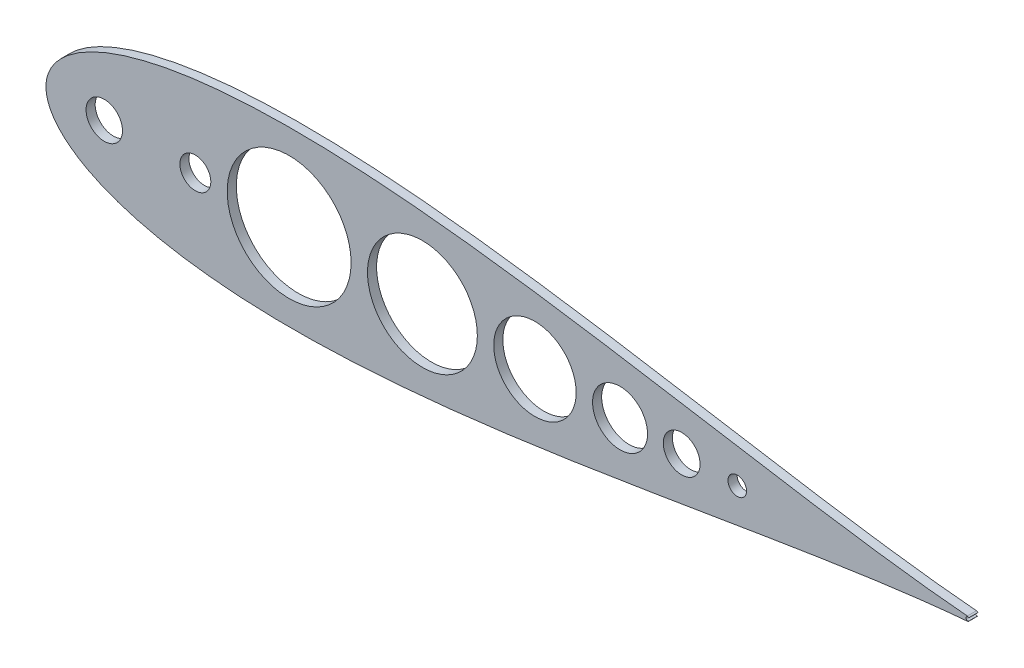
ISO-10303-21;
HEADER;
FILE_DESCRIPTION(('STEP AP214'),'2;1');
FILE_NAME('part.step','',(''),(''),'','','');
FILE_SCHEMA(('AUTOMOTIVE_DESIGN { 1 0 10303 214 1 1 1 1 }'));
ENDSEC;
DATA;
#1=APPLICATION_CONTEXT('core data for automotive mechanical design processes');
#2=APPLICATION_PROTOCOL_DEFINITION('international standard','automotive_design',2000,#1);
#3=PRODUCT_CONTEXT('',#1,'mechanical');
#4=PRODUCT('Part','Part','',(#3));
#5=PRODUCT_RELATED_PRODUCT_CATEGORY('part','',(#4));
#6=PRODUCT_DEFINITION_FORMATION('','',#4);
#7=PRODUCT_DEFINITION_CONTEXT('part definition',#1,'design');
#8=PRODUCT_DEFINITION('design','',#6,#7);
#9=PRODUCT_DEFINITION_SHAPE('','',#8);
#10=(LENGTH_UNIT() NAMED_UNIT(*) SI_UNIT(.MILLI.,.METRE.));
#11=(NAMED_UNIT(*) PLANE_ANGLE_UNIT() SI_UNIT($,.RADIAN.));
#12=(NAMED_UNIT(*) SI_UNIT($,.STERADIAN.) SOLID_ANGLE_UNIT());
#13=UNCERTAINTY_MEASURE_WITH_UNIT(LENGTH_MEASURE(1.E-05),#10,'distance_accuracy_value','');
#14=(GEOMETRIC_REPRESENTATION_CONTEXT(3) GLOBAL_UNCERTAINTY_ASSIGNED_CONTEXT((#13)) GLOBAL_UNIT_ASSIGNED_CONTEXT((#10,
#11,#12)) REPRESENTATION_CONTEXT('',''));
#15=CARTESIAN_POINT('',(0.,0.,0.));
#16=DIRECTION('',(0.,0.,1.));
#17=DIRECTION('',(1.,0.,0.));
#18=AXIS2_PLACEMENT_3D('',#15,#16,#17);
#19=CARTESIAN_POINT('',(670.559999999995,-4.68653165320437E-13,6.34999999999986));
#20=CARTESIAN_POINT('',(670.559999999995,0.0156785949263688,6.34999999999986));
#21=CARTESIAN_POINT('',(666.344759682881,0.0546967077378405,6.34999999999986));
#22=CARTESIAN_POINT('',(662.850933167962,0.234427605388089,6.34999999999986));
#23=CARTESIAN_POINT('',(656.504964310744,0.543558382914457,6.34999999999986));
#24=CARTESIAN_POINT('',(649.292951764016,1.0347712527945,6.34999999999986));
#25=CARTESIAN_POINT('',(640.491559639747,1.73191957841824,6.34999999999986));
#26=CARTESIAN_POINT('',(630.413817461932,2.66338549322046,6.34999999999986));
#27=CARTESIAN_POINT('',(619.014124193098,3.84925366408526,6.34999999999986));
#28=CARTESIAN_POINT('',(606.374988512377,5.30442898343126,6.34999999999986));
#29=CARTESIAN_POINT('',(592.543922516213,7.0376349071005,6.34999999999986));
#30=CARTESIAN_POINT('',(577.585454095334,9.05063614704178,6.34999999999986));
#31=CARTESIAN_POINT('',(561.564270734495,11.338919624911,6.34999999999986));
#32=CARTESIAN_POINT('',(544.549749945779,13.8906653749142,6.34999999999986));
#33=CARTESIAN_POINT('',(526.614143657611,16.6877207529691,6.34999999999986));
#34=CARTESIAN_POINT('',(507.832591566435,19.705111662944,6.34999999999986));
#35=CARTESIAN_POINT('',(488.282710288458,22.9116726009051,6.34999999999986));
#36=CARTESIAN_POINT('',(468.044367734568,26.2704360601485,6.34999999999986));
#37=CARTESIAN_POINT('',(447.199424328285,29.7390074319527,6.34999999999986));
#38=CARTESIAN_POINT('',(425.831595832132,33.2703241206413,6.34999999999986));
#39=CARTESIAN_POINT('',(404.026315660115,36.8132205450789,6.34999999999986));
#40=CARTESIAN_POINT('',(381.870662855573,40.3132668564462,6.34999999999986));
#41=CARTESIAN_POINT('',(359.45331489519,43.7135025323022,6.34999999999986));
#42=CARTESIAN_POINT('',(336.864544150042,46.9554474567624,6.34999999999986));
#43=CARTESIAN_POINT('',(314.196207315011,49.9798438951445,6.34999999999986));
#44=CARTESIAN_POINT('',(291.541767703988,52.7277127038913,6.34999999999986));
#45=CARTESIAN_POINT('',(268.996310773138,55.1412010116264,6.34999999999986));
#46=CARTESIAN_POINT('',(246.656558649997,57.1646038288049,6.34999999999986));
#47=CARTESIAN_POINT('',(224.6208608972,58.7451766411795,6.34999999999986));
#48=CARTESIAN_POINT('',(202.989192599402,59.8341217002374,6.34999999999986));
#49=CARTESIAN_POINT('',(181.863132616041,60.3875061421196,6.34999999999986));
#50=CARTESIAN_POINT('',(161.345829026567,60.3669613241368,6.34999999999986));
#51=CARTESIAN_POINT('',(141.542033827971,59.7398958243373,6.34999999999986));
#52=CARTESIAN_POINT('',(122.558104572901,58.481758103839,6.34999999999986));
#53=CARTESIAN_POINT('',(104.502313427195,56.5743039322429,6.34999999999986));
#54=CARTESIAN_POINT('',(87.4850186361542,54.0089351991651,6.34999999999986));
#55=CARTESIAN_POINT('',(71.6196960831894,50.7847520029954,6.34999999999986));
#56=CARTESIAN_POINT('',(57.0237097246995,46.9125430655855,6.34999999999986));
#57=CARTESIAN_POINT('',(43.8204543300273,42.4150024601013,6.34999999999986));
#58=CARTESIAN_POINT('',(32.1416452388821,37.3322040286459,6.34999999999986));
#59=CARTESIAN_POINT('',(22.1291073753191,31.7314553388242,6.34999999999986));
#60=CARTESIAN_POINT('',(13.932423523913,25.7264121059533,6.34999999999986));
#61=CARTESIAN_POINT('',(7.68961648909836,19.5132076319132,6.34999999999986));
#62=CARTESIAN_POINT('',(3.46313634309121,13.4203544206608,6.34999999999986));
#63=CARTESIAN_POINT('',(1.10633322756684,7.92338943472271,6.34999999999986));
#64=CARTESIAN_POINT('',(0.154611581573608,3.51379661507287,6.34999999999986));
#65=CARTESIAN_POINT('',(-0.062151597606766,1.52655665885959E-13,6.34999999999986));
#66=CARTESIAN_POINT('',(0.154611581573649,-3.51379661507316,6.34999999999986));
#67=CARTESIAN_POINT('',(1.10633322756687,-7.92338943472271,6.34999999999986));
#68=CARTESIAN_POINT('',(3.46313634309126,-13.420354420661,6.34999999999986));
#69=CARTESIAN_POINT('',(7.6896164890982,-19.5132076319134,6.34999999999986));
#70=CARTESIAN_POINT('',(13.9324235239131,-25.7264121059535,6.34999999999986));
#71=CARTESIAN_POINT('',(22.1291073753193,-31.7314553388245,6.34999999999986));
#72=CARTESIAN_POINT('',(32.1416452388821,-37.3322040286461,6.34999999999986));
#73=CARTESIAN_POINT('',(43.8204543300276,-42.4150024601015,6.34999999999986));
#74=CARTESIAN_POINT('',(57.0237097246994,-46.9125430655857,6.34999999999986));
#75=CARTESIAN_POINT('',(71.6196960831895,-50.7847520029956,6.34999999999986));
#76=CARTESIAN_POINT('',(87.4850186361541,-54.0089351991653,6.34999999999986));
#77=CARTESIAN_POINT('',(104.502313427195,-56.5743039322431,6.34999999999986));
#78=CARTESIAN_POINT('',(122.558104572901,-58.4817581038392,6.34999999999986));
#79=CARTESIAN_POINT('',(141.542033827971,-59.7398958243373,6.34999999999986));
#80=CARTESIAN_POINT('',(161.345829026567,-60.3669613241367,6.34999999999986));
#81=CARTESIAN_POINT('',(181.863132616041,-60.3875061421197,6.34999999999986));
#82=CARTESIAN_POINT('',(202.989192599402,-59.8341217002374,6.34999999999986));
#83=CARTESIAN_POINT('',(224.6208608972,-58.7451766411793,6.34999999999986));
#84=CARTESIAN_POINT('',(246.656558649996,-57.1646038288046,6.34999999999986));
#85=CARTESIAN_POINT('',(268.996310773136,-55.1412010116262,6.34999999999986));
#86=CARTESIAN_POINT('',(291.541767703988,-52.727712703891,6.34999999999986));
#87=CARTESIAN_POINT('',(314.19620731501,-49.9798438951439,6.34999999999986));
#88=CARTESIAN_POINT('',(336.864544150042,-46.9554474567621,6.34999999999986));
#89=CARTESIAN_POINT('',(359.453314895188,-43.7135025323018,6.34999999999986));
#90=CARTESIAN_POINT('',(381.870662855573,-40.3132668564457,6.34999999999986));
#91=CARTESIAN_POINT('',(404.026315660113,-36.8132205450786,6.34999999999986));
#92=CARTESIAN_POINT('',(425.831595832131,-33.2703241206408,6.34999999999986));
#93=CARTESIAN_POINT('',(447.199424328285,-29.7390074319522,6.34999999999986));
#94=CARTESIAN_POINT('',(468.044367734567,-26.2704360601482,6.34999999999986));
#95=CARTESIAN_POINT('',(488.282710288458,-22.9116726009046,6.34999999999986));
#96=CARTESIAN_POINT('',(507.832591566435,-19.7051116629438,6.34999999999986));
#97=CARTESIAN_POINT('',(526.614143657612,-16.6877207529685,6.34999999999986));
#98=CARTESIAN_POINT('',(544.54974994578,-13.890665374914,6.34999999999986));
#99=CARTESIAN_POINT('',(561.564270734495,-11.3389196249107,6.34999999999986));
#100=CARTESIAN_POINT('',(577.585454095334,-9.0506361470414,6.34999999999986));
#101=CARTESIAN_POINT('',(592.543922516212,-7.03763490710037,6.34999999999986));
#102=CARTESIAN_POINT('',(606.374988512377,-5.30442898343094,6.34999999999986));
#103=CARTESIAN_POINT('',(619.014124193097,-3.84925366408511,6.34999999999986));
#104=CARTESIAN_POINT('',(630.413817461931,-2.66338549322031,6.34999999999986));
#105=CARTESIAN_POINT('',(640.491559639746,-1.73191957841822,6.34999999999986));
#106=CARTESIAN_POINT('',(649.292951764016,-1.03477125279468,6.34999999999986));
#107=CARTESIAN_POINT('',(656.504964310745,-0.543558382914665,6.34999999999986));
#108=CARTESIAN_POINT('',(662.850933167962,-0.234427605389047,6.34999999999986));
#109=CARTESIAN_POINT('',(666.34475968288,-0.0546967077383817,6.34999999999986));
#110=CARTESIAN_POINT('',(670.559999999995,-0.0156785949273065,6.34999999999986));
#111=CARTESIAN_POINT('',(670.559999999995,-4.68653165320437E-13,6.34999999999986));
#112=B_SPLINE_CURVE_WITH_KNOTS('',3,(#19,#20,#21,#22,#23,#24,#25,#26,#27,#28,#29,#30,#31,#32,
#33,#34,#35,#36,#37,#38,#39,#40,#41,#42,#43,#44,#45,#46,#47,#48,#49,#50,#51,#52,#53,#54,#55,#56,
#57,#58,#59,#60,#61,#62,#63,#64,#65,#66,#67,#68,#69,#70,#71,#72,#73,#74,#75,#76,#77,#78,#79,#80,
#81,#82,#83,#84,#85,#86,#87,#88,#89,#90,#91,#92,#93,#94,#95,#96,#97,#98,#99,#100,#101,#102,#103,
#104,#105,#106,#107,#108,#109,#110,#111),.UNSPECIFIED.,.T.,.F.,(4,1,1,1,1,1,1,1,1,1,1,1,1,1,1,1,
1,1,1,1,1,1,1,1,1,1,1,1,1,1,1,1,1,1,1,1,1,1,1,1,1,1,1,1,1,1,1,1,1,1,1,1,1,1,1,1,1,1,1,1,1,1,1,1,
1,1,1,1,1,1,1,1,1,1,1,1,1,1,1,1,1,1,1,1,1,1,1,1,1,1,4),(0.,0.00216777795588342,
0.00539478220000884,0.00966720698444134,0.0149667883303173,0.0212708876900959,
0.0285525550130683,0.0367806836725549,0.0459201019032637,0.0559317636633187,0.0667728836144854,
0.0783971303496518,0.0907548266908363,0.103793164577546,0.117456431914319,0.131686225652521,
0.146421738497113,0.161599998000845,0.177156132626574,0.193023668070302,0.209134785631037,
0.225420632511523,0.241811601924249,0.258237646860869,0.274628556698349,0.290914287398014,
0.307025228908797,0.322892517177238,0.33844834182358,0.353626206573582,0.368361231970712,
0.382590427827798,0.396252960572084,0.40929041186716,0.421647009590256,0.433269881487031,
0.444109248914041,0.454118639688981,0.463255054987312,0.471479113777303,0.478755288570903,
0.485052318112802,0.490344025694165,0.494609832614287,0.497833231437255,0.5,0.502166768562745,
0.505390167385713,0.509655974305835,0.514947681887198,0.521244711429097,0.528520886222697,
0.536744945012688,0.545881360311019,0.555890751085959,0.566730118512969,0.578352990409744,
0.59070958813284,0.603747039427916,0.617409572172202,0.631638768029288,0.646373793426418,
0.66155165817642,0.677107482822761,0.692974771091203,0.709085712601986,0.725371443301651,
0.741762353139131,0.758188398075751,0.774579367488477,0.790865214368963,0.806976331929698,
0.822843867373426,0.838400001999155,0.853578261502887,0.868313774347479,0.882543568085681,
0.896206835422454,0.909245173309164,0.921602869650348,0.933227116385514,0.944068236336681,
0.954079898096736,0.963219316327445,0.971447444986932,0.978729112309904,0.985033211669683,
0.990332793015559,0.994605217799991,0.997832222044117,1.),.UNSPECIFIED.);
#113=DIRECTION('',(0.,0.,-1.));
#114=VECTOR('',#113,1.);
#115=SURFACE_OF_LINEAR_EXTRUSION('',#112,#114);
#116=CARTESIAN_POINT('',(670.559999999995,-4.68653165320437E-13,0.));
#117=CARTESIAN_POINT('',(670.559999999995,0.0156785949263688,0.));
#118=CARTESIAN_POINT('',(666.344759682881,0.0546967077378405,0.));
#119=CARTESIAN_POINT('',(662.850933167962,0.234427605388089,0.));
#120=CARTESIAN_POINT('',(656.504964310744,0.543558382914457,0.));
#121=CARTESIAN_POINT('',(649.292951764016,1.0347712527945,0.));
#122=CARTESIAN_POINT('',(640.491559639747,1.73191957841824,0.));
#123=CARTESIAN_POINT('',(630.413817461932,2.66338549322046,0.));
#124=CARTESIAN_POINT('',(619.014124193098,3.84925366408526,0.));
#125=CARTESIAN_POINT('',(606.374988512377,5.30442898343126,0.));
#126=CARTESIAN_POINT('',(592.543922516213,7.0376349071005,0.));
#127=CARTESIAN_POINT('',(577.585454095334,9.05063614704178,0.));
#128=CARTESIAN_POINT('',(561.564270734495,11.338919624911,0.));
#129=CARTESIAN_POINT('',(544.549749945779,13.8906653749142,0.));
#130=CARTESIAN_POINT('',(526.614143657611,16.6877207529691,0.));
#131=CARTESIAN_POINT('',(507.832591566435,19.705111662944,0.));
#132=CARTESIAN_POINT('',(488.282710288458,22.9116726009051,0.));
#133=CARTESIAN_POINT('',(468.044367734568,26.2704360601485,0.));
#134=CARTESIAN_POINT('',(447.199424328285,29.7390074319527,0.));
#135=CARTESIAN_POINT('',(425.831595832132,33.2703241206413,0.));
#136=CARTESIAN_POINT('',(404.026315660115,36.8132205450789,0.));
#137=CARTESIAN_POINT('',(381.870662855573,40.3132668564462,0.));
#138=CARTESIAN_POINT('',(359.45331489519,43.7135025323022,0.));
#139=CARTESIAN_POINT('',(336.864544150042,46.9554474567624,0.));
#140=CARTESIAN_POINT('',(314.196207315011,49.9798438951445,0.));
#141=CARTESIAN_POINT('',(291.541767703988,52.7277127038913,0.));
#142=CARTESIAN_POINT('',(268.996310773138,55.1412010116264,0.));
#143=CARTESIAN_POINT('',(246.656558649997,57.1646038288049,0.));
#144=CARTESIAN_POINT('',(224.6208608972,58.7451766411795,0.));
#145=CARTESIAN_POINT('',(202.989192599402,59.8341217002374,0.));
#146=CARTESIAN_POINT('',(181.863132616041,60.3875061421196,0.));
#147=CARTESIAN_POINT('',(161.345829026567,60.3669613241368,0.));
#148=CARTESIAN_POINT('',(141.542033827971,59.7398958243373,0.));
#149=CARTESIAN_POINT('',(122.558104572901,58.481758103839,0.));
#150=CARTESIAN_POINT('',(104.502313427195,56.5743039322429,0.));
#151=CARTESIAN_POINT('',(87.4850186361542,54.0089351991651,0.));
#152=CARTESIAN_POINT('',(71.6196960831894,50.7847520029954,0.));
#153=CARTESIAN_POINT('',(57.0237097246996,46.9125430655856,0.));
#154=CARTESIAN_POINT('',(43.8204543300273,42.4150024601013,0.));
#155=CARTESIAN_POINT('',(32.1416452388821,37.3322040286459,0.));
#156=CARTESIAN_POINT('',(22.1291073753191,31.7314553388242,0.));
#157=CARTESIAN_POINT('',(13.932423523913,25.7264121059533,0.));
#158=CARTESIAN_POINT('',(7.68961648909836,19.5132076319132,0.));
#159=CARTESIAN_POINT('',(3.46313634309121,13.4203544206608,0.));
#160=CARTESIAN_POINT('',(1.10633322756684,7.92338943472271,0.));
#161=CARTESIAN_POINT('',(0.154611581573608,3.51379661507287,0.));
#162=CARTESIAN_POINT('',(-0.062151597606766,1.52655665885959E-13,0.));
#163=CARTESIAN_POINT('',(0.154611581573649,-3.51379661507316,0.));
#164=CARTESIAN_POINT('',(1.10633322756687,-7.92338943472271,0.));
#165=CARTESIAN_POINT('',(3.46313634309126,-13.420354420661,0.));
#166=CARTESIAN_POINT('',(7.6896164890982,-19.5132076319134,0.));
#167=CARTESIAN_POINT('',(13.9324235239131,-25.7264121059535,0.));
#168=CARTESIAN_POINT('',(22.1291073753193,-31.7314553388245,0.));
#169=CARTESIAN_POINT('',(32.1416452388821,-37.3322040286461,0.));
#170=CARTESIAN_POINT('',(43.8204543300276,-42.4150024601015,0.));
#171=CARTESIAN_POINT('',(57.0237097246994,-46.9125430655857,0.));
#172=CARTESIAN_POINT('',(71.6196960831895,-50.7847520029956,0.));
#173=CARTESIAN_POINT('',(87.4850186361541,-54.0089351991653,0.));
#174=CARTESIAN_POINT('',(104.502313427195,-56.5743039322432,0.));
#175=CARTESIAN_POINT('',(122.558104572901,-58.4817581038392,0.));
#176=CARTESIAN_POINT('',(141.542033827971,-59.7398958243373,0.));
#177=CARTESIAN_POINT('',(161.345829026567,-60.3669613241368,0.));
#178=CARTESIAN_POINT('',(181.863132616041,-60.3875061421197,0.));
#179=CARTESIAN_POINT('',(202.989192599402,-59.8341217002374,0.));
#180=CARTESIAN_POINT('',(224.6208608972,-58.7451766411793,0.));
#181=CARTESIAN_POINT('',(246.656558649996,-57.1646038288046,0.));
#182=CARTESIAN_POINT('',(268.996310773136,-55.1412010116262,0.));
#183=CARTESIAN_POINT('',(291.541767703988,-52.727712703891,0.));
#184=CARTESIAN_POINT('',(314.19620731501,-49.9798438951439,0.));
#185=CARTESIAN_POINT('',(336.864544150042,-46.9554474567621,0.));
#186=CARTESIAN_POINT('',(359.453314895188,-43.7135025323018,0.));
#187=CARTESIAN_POINT('',(381.870662855573,-40.3132668564457,0.));
#188=CARTESIAN_POINT('',(404.026315660113,-36.8132205450786,0.));
#189=CARTESIAN_POINT('',(425.831595832131,-33.2703241206408,0.));
#190=CARTESIAN_POINT('',(447.199424328285,-29.7390074319522,0.));
#191=CARTESIAN_POINT('',(468.044367734567,-26.2704360601482,0.));
#192=CARTESIAN_POINT('',(488.282710288458,-22.9116726009046,0.));
#193=CARTESIAN_POINT('',(507.832591566435,-19.7051116629438,0.));
#194=CARTESIAN_POINT('',(526.614143657612,-16.6877207529685,0.));
#195=CARTESIAN_POINT('',(544.54974994578,-13.890665374914,0.));
#196=CARTESIAN_POINT('',(561.564270734495,-11.3389196249107,0.));
#197=CARTESIAN_POINT('',(577.585454095334,-9.0506361470414,0.));
#198=CARTESIAN_POINT('',(592.543922516212,-7.03763490710037,0.));
#199=CARTESIAN_POINT('',(606.374988512377,-5.30442898343094,0.));
#200=CARTESIAN_POINT('',(619.014124193097,-3.84925366408511,0.));
#201=CARTESIAN_POINT('',(630.413817461931,-2.66338549322031,0.));
#202=CARTESIAN_POINT('',(640.491559639746,-1.73191957841822,0.));
#203=CARTESIAN_POINT('',(649.292951764016,-1.03477125279468,0.));
#204=CARTESIAN_POINT('',(656.504964310745,-0.543558382914665,0.));
#205=CARTESIAN_POINT('',(662.850933167962,-0.234427605389047,0.));
#206=CARTESIAN_POINT('',(666.34475968288,-0.0546967077383817,0.));
#207=CARTESIAN_POINT('',(670.559999999995,-0.0156785949273065,0.));
#208=CARTESIAN_POINT('',(670.559999999995,-4.68653165320437E-13,0.));
#209=B_SPLINE_CURVE_WITH_KNOTS('',3,(#116,#117,#118,#119,#120,#121,#122,#123,#124,#125,#126,
#127,#128,#129,#130,#131,#132,#133,#134,#135,#136,#137,#138,#139,#140,#141,#142,#143,#144,#145,
#146,#147,#148,#149,#150,#151,#152,#153,#154,#155,#156,#157,#158,#159,#160,#161,#162,#163,#164,
#165,#166,#167,#168,#169,#170,#171,#172,#173,#174,#175,#176,#177,#178,#179,#180,#181,#182,#183,
#184,#185,#186,#187,#188,#189,#190,#191,#192,#193,#194,#195,#196,#197,#198,#199,#200,#201,#202,
#203,#204,#205,#206,#207,#208),.UNSPECIFIED.,.T.,.F.,(4,1,1,1,1,1,1,1,1,1,1,1,1,1,1,1,1,1,1,1,1,
1,1,1,1,1,1,1,1,1,1,1,1,1,1,1,1,1,1,1,1,1,1,1,1,1,1,1,1,1,1,1,1,1,1,1,1,1,1,1,1,1,1,1,1,1,1,1,1,
1,1,1,1,1,1,1,1,1,1,1,1,1,1,1,1,1,1,1,1,1,4),(0.,0.00216777795588342,0.00539478220000884,
0.00966720698444134,0.0149667883303173,0.0212708876900959,0.0285525550130683,0.0367806836725549,
0.0459201019032637,0.0559317636633187,0.0667728836144854,0.0783971303496518,0.0907548266908363,
0.103793164577546,0.117456431914319,0.131686225652521,0.146421738497113,0.161599998000845,
0.177156132626574,0.193023668070302,0.209134785631037,0.225420632511523,0.241811601924249,
0.258237646860869,0.274628556698349,0.290914287398014,0.307025228908797,0.322892517177238,
0.33844834182358,0.353626206573582,0.368361231970712,0.382590427827798,0.396252960572084,
0.40929041186716,0.421647009590256,0.433269881487031,0.444109248914041,0.454118639688981,
0.463255054987312,0.471479113777303,0.478755288570903,0.485052318112802,0.490344025694165,
0.494609832614287,0.497833231437255,0.5,0.502166768562745,0.505390167385713,0.509655974305835,
0.514947681887198,0.521244711429097,0.528520886222697,0.536744945012688,0.545881360311019,
0.555890751085959,0.566730118512969,0.578352990409744,0.59070958813284,0.603747039427916,
0.617409572172202,0.631638768029288,0.646373793426418,0.66155165817642,0.677107482822761,
0.692974771091203,0.709085712601986,0.725371443301651,0.741762353139131,0.758188398075751,
0.774579367488477,0.790865214368963,0.806976331929698,0.822843867373426,0.838400001999155,
0.853578261502887,0.868313774347479,0.882543568085681,0.896206835422454,0.909245173309164,
0.921602869650348,0.933227116385514,0.944068236336681,0.954079898096736,0.963219316327445,
0.971447444986932,0.978729112309904,0.985033211669683,0.990332793015559,0.994605217799991,
0.997832222044117,1.),.UNSPECIFIED.);
#210=CARTESIAN_POINT('',(642.510849283039,1.58203911233987,0.));
#211=VERTEX_POINT('',#210);
#212=CARTESIAN_POINT('',(642.51084928304,-1.58203911233961,0.));
#213=VERTEX_POINT('',#212);
#214=EDGE_CURVE('E86',#211,#213,#209,.T.);
#215=ORIENTED_EDGE('',*,*,#214,.T.);
#216=DIRECTION('',(0.,0.,-1.));
#217=VECTOR('',#216,1.);
#218=CARTESIAN_POINT('',(642.51084928304,-1.58203911233961,6.34999999999986));
#219=LINE('',#218,#217);
#220=CARTESIAN_POINT('',(642.51084928304,-1.58203911233961,6.34999999999986));
#221=VERTEX_POINT('',#220);
#222=EDGE_CURVE('E13',#221,#213,#219,.T.);
#223=ORIENTED_EDGE('',*,*,#222,.F.);
#224=CARTESIAN_POINT('',(642.510849283039,1.58203911233987,6.34999999999986));
#225=VERTEX_POINT('',#224);
#226=EDGE_CURVE('E91',#225,#221,#112,.T.);
#227=ORIENTED_EDGE('',*,*,#226,.F.);
#228=DIRECTION('',(0.,0.,-1.));
#229=VECTOR('',#228,1.);
#230=CARTESIAN_POINT('',(642.510849283039,1.58203911233987,6.34999999999986));
#231=LINE('',#230,#229);
#232=EDGE_CURVE('E110',#225,#211,#231,.T.);
#233=ORIENTED_EDGE('',*,*,#232,.T.);
#234=EDGE_LOOP('',(#215,#223,#227,#233));
#235=FACE_BOUND('',#234,.T.);
#236=ADVANCED_FACE('F56',(#235),#115,.F.);
#237=CARTESIAN_POINT('',(642.379287521774,0.,6.34999999999986));
#238=DIRECTION('',(0.,0.,-1.));
#239=DIRECTION('',(-0.999999999999994,0.,0.));
#240=AXIS2_PLACEMENT_3D('',#237,#238,#239);
#241=CYLINDRICAL_SURFACE('',#240,1.58750000000001);
#242=CARTESIAN_POINT('',(642.379287521774,0.,0.));
#243=DIRECTION('',(0.,0.,1.));
#244=DIRECTION('',(0.999999999999994,0.,0.));
#245=AXIS2_PLACEMENT_3D('',#242,#243,#244);
#246=CIRCLE('',#245,1.58750000000001);
#247=CARTESIAN_POINT('',(643.599082689005,-1.01599999999965,0.));
#248=VERTEX_POINT('',#247);
#249=EDGE_CURVE('E106',#213,#248,#246,.T.);
#250=ORIENTED_EDGE('',*,*,#249,.T.);
#251=DIRECTION('',(0.,0.,-1.));
#252=VECTOR('',#251,1.);
#253=CARTESIAN_POINT('',(643.599082689005,-1.01599999999965,6.34999999999986));
#254=LINE('',#253,#252);
#255=CARTESIAN_POINT('',(643.599082689005,-1.01599999999965,6.34999999999986));
#256=VERTEX_POINT('',#255);
#257=EDGE_CURVE('E66',#256,#248,#254,.T.);
#258=ORIENTED_EDGE('',*,*,#257,.F.);
#259=CARTESIAN_POINT('',(642.379287521774,0.,6.34999999999986));
#260=DIRECTION('',(0.,0.,1.));
#261=DIRECTION('',(0.999999999999994,0.,0.));
#262=AXIS2_PLACEMENT_3D('',#259,#260,#261);
#263=CIRCLE('',#262,1.58750000000001);
#264=EDGE_CURVE('E75',#221,#256,#263,.T.);
#265=ORIENTED_EDGE('',*,*,#264,.F.);
#266=ORIENTED_EDGE('',*,*,#222,.T.);
#267=EDGE_LOOP('',(#250,#258,#265,#266));
#268=FACE_BOUND('',#267,.T.);
#269=ADVANCED_FACE('F221',(#268),#241,.T.);
#270=CARTESIAN_POINT('',(642.837082689005,0.,6.34999999999986));
#271=DIRECTION('',(0.,0.,-1.));
#272=DIRECTION('',(-0.999999999999994,0.,0.));
#273=AXIS2_PLACEMENT_3D('',#270,#271,#272);
#274=CYLINDRICAL_SURFACE('',#273,1.26999999999999);
#275=CARTESIAN_POINT('',(642.837082689005,0.,0.));
#276=DIRECTION('',(0.,0.,1.));
#277=DIRECTION('',(0.999999999999994,0.,0.));
#278=AXIS2_PLACEMENT_3D('',#275,#276,#277);
#279=CIRCLE('',#278,1.26999999999999);
#280=CARTESIAN_POINT('',(643.599082689004,1.01599999999994,0.));
#281=VERTEX_POINT('',#280);
#282=EDGE_CURVE('E151',#281,#248,#279,.T.);
#283=ORIENTED_EDGE('',*,*,#282,.F.);
#284=DIRECTION('',(0.,0.,-1.));
#285=VECTOR('',#284,1.);
#286=CARTESIAN_POINT('',(643.599082689004,1.01599999999994,6.34999999999986));
#287=LINE('',#286,#285);
#288=CARTESIAN_POINT('',(643.599082689004,1.01599999999994,6.34999999999986));
#289=VERTEX_POINT('',#288);
#290=EDGE_CURVE('E114',#289,#281,#287,.T.);
#291=ORIENTED_EDGE('',*,*,#290,.F.);
#292=CARTESIAN_POINT('',(642.837082689005,0.,6.34999999999986));
#293=DIRECTION('',(0.,0.,1.));
#294=DIRECTION('',(0.999999999999994,0.,0.));
#295=AXIS2_PLACEMENT_3D('',#292,#293,#294);
#296=CIRCLE('',#295,1.26999999999999);
#297=EDGE_CURVE('E134',#289,#256,#296,.T.);
#298=ORIENTED_EDGE('',*,*,#297,.T.);
#299=ORIENTED_EDGE('',*,*,#257,.T.);
#300=EDGE_LOOP('',(#283,#291,#298,#299));
#301=FACE_BOUND('',#300,.T.);
#302=ADVANCED_FACE('F225',(#301),#274,.F.);
#303=CARTESIAN_POINT('',(104.139999999999,0.,6.34999999999986));
#304=DIRECTION('',(0.,0.,-1.));
#305=DIRECTION('',(-0.999999999999994,0.,0.));
#306=AXIS2_PLACEMENT_3D('',#303,#304,#305);
#307=CYLINDRICAL_SURFACE('',#306,10.795);
#308=CARTESIAN_POINT('',(104.139999999999,0.,0.));
#309=DIRECTION('',(0.,0.,1.));
#310=DIRECTION('',(0.999999999999994,0.,0.));
#311=AXIS2_PLACEMENT_3D('',#308,#309,#310);
#312=CIRCLE('',#311,10.795);
#313=CARTESIAN_POINT('',(114.934999999999,0.,0.));
#314=VERTEX_POINT('',#313);
#315=EDGE_CURVE('E153',#314,#314,#312,.T.);
#316=ORIENTED_EDGE('',*,*,#315,.F.);
#317=EDGE_LOOP('',(#316));
#318=FACE_BOUND('',#317,.T.);
#319=CARTESIAN_POINT('',(104.139999999999,0.,6.34999999999986));
#320=DIRECTION('',(0.,0.,1.));
#321=DIRECTION('',(0.999999999999994,0.,0.));
#322=AXIS2_PLACEMENT_3D('',#319,#320,#321);
#323=CIRCLE('',#322,10.795);
#324=CARTESIAN_POINT('',(114.934999999999,0.,6.34999999999986));
#325=VERTEX_POINT('',#324);
#326=EDGE_CURVE('E137',#325,#325,#323,.T.);
#327=ORIENTED_EDGE('',*,*,#326,.T.);
#328=EDGE_LOOP('',(#327));
#329=FACE_BOUND('',#328,.T.);
#330=ADVANCED_FACE('F230',(#318,#329),#307,.F.);
#331=CARTESIAN_POINT('',(40.6399999999998,-1.14491749414469E-13,6.34999999999986));
#332=DIRECTION('',(0.,0.,-1.));
#333=DIRECTION('',(-0.999999999999994,0.,0.));
#334=AXIS2_PLACEMENT_3D('',#331,#332,#333);
#335=CYLINDRICAL_SURFACE('',#334,12.7);
#336=CARTESIAN_POINT('',(40.6399999999998,-1.14491749414469E-13,0.));
#337=DIRECTION('',(0.,0.,1.));
#338=DIRECTION('',(0.999999999999994,0.,0.));
#339=AXIS2_PLACEMENT_3D('',#336,#337,#338);
#340=CIRCLE('',#339,12.7);
#341=CARTESIAN_POINT('',(53.3399999999997,-1.14491749414469E-13,0.));
#342=VERTEX_POINT('',#341);
#343=EDGE_CURVE('E129',#342,#342,#340,.T.);
#344=ORIENTED_EDGE('',*,*,#343,.F.);
#345=EDGE_LOOP('',(#344));
#346=FACE_BOUND('',#345,.T.);
#347=CARTESIAN_POINT('',(40.6399999999998,-1.14491749414469E-13,6.34999999999986));
#348=DIRECTION('',(0.,0.,1.));
#349=DIRECTION('',(0.999999999999994,0.,0.));
#350=AXIS2_PLACEMENT_3D('',#347,#348,#349);
#351=CIRCLE('',#350,12.7);
#352=CARTESIAN_POINT('',(53.3399999999997,-1.14491749414469E-13,6.34999999999986));
#353=VERTEX_POINT('',#352);
#354=EDGE_CURVE('E141',#353,#353,#351,.T.);
#355=ORIENTED_EDGE('',*,*,#354,.T.);
#356=EDGE_LOOP('',(#355));
#357=FACE_BOUND('',#356,.T.);
#358=ADVANCED_FACE('F236',(#346,#357),#335,.F.);
#359=CARTESIAN_POINT('',(0.,0.,6.34999999999986));
#360=DIRECTION('',(0.,0.,1.));
#361=DIRECTION('',(0.999999999999994,0.,0.));
#362=AXIS2_PLACEMENT_3D('',#359,#360,#361);
#363=PLANE('',#362);
#364=ORIENTED_EDGE('',*,*,#354,.F.);
#365=EDGE_LOOP('',(#364));
#366=FACE_BOUND('',#365,.T.);
#367=ORIENTED_EDGE('',*,*,#326,.F.);
#368=EDGE_LOOP('',(#367));
#369=FACE_BOUND('',#368,.T.);
#370=ORIENTED_EDGE('',*,*,#297,.F.);
#371=CARTESIAN_POINT('',(642.379287521774,0.,6.34999999999986));
#372=DIRECTION('',(0.,0.,-1.));
#373=DIRECTION('',(0.999999999999994,0.,0.));
#374=AXIS2_PLACEMENT_3D('',#371,#372,#373);
#375=CIRCLE('',#374,1.58750000000001);
#376=EDGE_CURVE('E115',#225,#289,#375,.T.);
#377=ORIENTED_EDGE('',*,*,#376,.F.);
#378=ORIENTED_EDGE('',*,*,#226,.T.);
#379=ORIENTED_EDGE('',*,*,#264,.T.);
#380=EDGE_LOOP('',(#370,#377,#378,#379));
#381=FACE_BOUND('',#380,.T.);
#382=CARTESIAN_POINT('',(482.082534569449,-3.81639164714898E-13,6.34999999999986));
#383=DIRECTION('',(0.,0.,1.));
#384=DIRECTION('',(0.999999999999994,0.,0.));
#385=AXIS2_PLACEMENT_3D('',#382,#383,#384);
#386=CIRCLE('',#385,6.47700000000001);
#387=CARTESIAN_POINT('',(488.559534569449,-3.81639164714898E-13,6.34999999999986));
#388=VERTEX_POINT('',#387);
#389=EDGE_CURVE('E164',#388,#388,#386,.T.);
#390=ORIENTED_EDGE('',*,*,#389,.F.);
#391=EDGE_LOOP('',(#390));
#392=FACE_BOUND('',#391,.T.);
#393=CARTESIAN_POINT('',(443.301866123464,6.03683769639929E-13,6.34999999999986));
#394=DIRECTION('',(0.,0.,1.));
#395=DIRECTION('',(0.999999999999994,0.,0.));
#396=AXIS2_PLACEMENT_3D('',#393,#394,#395);
#397=CIRCLE('',#396,12.827);
#398=CARTESIAN_POINT('',(456.128866123463,6.03683769639929E-13,6.34999999999986));
#399=VERTEX_POINT('',#398);
#400=EDGE_CURVE('E168',#399,#399,#397,.T.);
#401=ORIENTED_EDGE('',*,*,#400,.F.);
#402=EDGE_LOOP('',(#401));
#403=FACE_BOUND('',#402,.T.);
#404=CARTESIAN_POINT('',(400.327663748455,0.,6.34999999999986));
#405=DIRECTION('',(0.,0.,1.));
#406=DIRECTION('',(0.999999999999994,0.,0.));
#407=AXIS2_PLACEMENT_3D('',#404,#405,#406);
#408=CIRCLE('',#407,19.177);
#409=CARTESIAN_POINT('',(419.504663748455,0.,6.34999999999986));
#410=VERTEX_POINT('',#409);
#411=EDGE_CURVE('E173',#410,#410,#408,.T.);
#412=ORIENTED_EDGE('',*,*,#411,.F.);
#413=EDGE_LOOP('',(#412));
#414=FACE_BOUND('',#413,.T.);
#415=CARTESIAN_POINT('',(340.97990775381,0.,6.34999999999986));
#416=DIRECTION('',(0.,0.,1.));
#417=DIRECTION('',(0.999999999999994,0.,0.));
#418=AXIS2_PLACEMENT_3D('',#415,#416,#417);
#419=CIRCLE('',#418,28.7407559946448);
#420=CARTESIAN_POINT('',(369.720663748455,0.,6.34999999999986));
#421=VERTEX_POINT('',#420);
#422=EDGE_CURVE('E177',#421,#421,#419,.T.);
#423=ORIENTED_EDGE('',*,*,#422,.F.);
#424=EDGE_LOOP('',(#423));
#425=FACE_BOUND('',#424,.T.);
#426=CARTESIAN_POINT('',(262.503550953444,0.,6.34999999999986));
#427=DIRECTION('',(0.,0.,1.));
#428=DIRECTION('',(0.999999999999994,0.,0.));
#429=AXIS2_PLACEMENT_3D('',#426,#427,#428);
#430=CIRCLE('',#429,38.3056008057221);
#431=CARTESIAN_POINT('',(300.809151759166,0.,6.34999999999986));
#432=VERTEX_POINT('',#431);
#433=EDGE_CURVE('E181',#432,#432,#430,.T.);
#434=ORIENTED_EDGE('',*,*,#433,.F.);
#435=EDGE_LOOP('',(#434));
#436=FACE_BOUND('',#435,.T.);
#437=CARTESIAN_POINT('',(169.566475073861,0.,6.34999999999986));
#438=DIRECTION('',(0.,0.,1.));
#439=DIRECTION('',(0.999999999999994,0.,0.));
#440=AXIS2_PLACEMENT_3D('',#437,#438,#439);
#441=CIRCLE('',#440,43.2014750738616);
#442=CARTESIAN_POINT('',(212.767950147722,0.,6.34999999999986));
#443=VERTEX_POINT('',#442);
#444=EDGE_CURVE('E108',#443,#443,#441,.T.);
#445=ORIENTED_EDGE('',*,*,#444,.F.);
#446=EDGE_LOOP('',(#445));
#447=FACE_BOUND('',#446,.T.);
#448=ADVANCED_FACE('F240',(#366,#369,#381,#392,#403,#414,#425,#436,#447),#363,.T.);
#449=CARTESIAN_POINT('',(0.,0.,0.));
#450=DIRECTION('',(0.,0.,1.));
#451=DIRECTION('',(0.999999999999994,0.,0.));
#452=AXIS2_PLACEMENT_3D('',#449,#450,#451);
#453=PLANE('',#452);
#454=CARTESIAN_POINT('',(169.566475073861,0.,0.));
#455=DIRECTION('',(0.,0.,1.));
#456=DIRECTION('',(0.999999999999994,0.,0.));
#457=AXIS2_PLACEMENT_3D('',#454,#455,#456);
#458=CIRCLE('',#457,43.2014750738616);
#459=CARTESIAN_POINT('',(212.767950147722,0.,0.));
#460=VERTEX_POINT('',#459);
#461=EDGE_CURVE('E60',#460,#460,#458,.T.);
#462=ORIENTED_EDGE('',*,*,#461,.T.);
#463=EDGE_LOOP('',(#462));
#464=FACE_BOUND('',#463,.T.);
#465=CARTESIAN_POINT('',(262.503550953444,0.,0.));
#466=DIRECTION('',(0.,0.,1.));
#467=DIRECTION('',(0.999999999999994,0.,0.));
#468=AXIS2_PLACEMENT_3D('',#465,#466,#467);
#469=CIRCLE('',#468,38.3056008057221);
#470=CARTESIAN_POINT('',(300.809151759166,0.,0.));
#471=VERTEX_POINT('',#470);
#472=EDGE_CURVE('E169',#471,#471,#469,.T.);
#473=ORIENTED_EDGE('',*,*,#472,.T.);
#474=EDGE_LOOP('',(#473));
#475=FACE_BOUND('',#474,.T.);
#476=CARTESIAN_POINT('',(340.97990775381,0.,0.));
#477=DIRECTION('',(0.,0.,1.));
#478=DIRECTION('',(0.999999999999994,0.,0.));
#479=AXIS2_PLACEMENT_3D('',#476,#477,#478);
#480=CIRCLE('',#479,28.7407559946448);
#481=CARTESIAN_POINT('',(369.720663748455,0.,0.));
#482=VERTEX_POINT('',#481);
#483=EDGE_CURVE('E188',#482,#482,#480,.T.);
#484=ORIENTED_EDGE('',*,*,#483,.T.);
#485=EDGE_LOOP('',(#484));
#486=FACE_BOUND('',#485,.T.);
#487=CARTESIAN_POINT('',(400.327663748455,0.,0.));
#488=DIRECTION('',(0.,0.,1.));
#489=DIRECTION('',(0.999999999999994,0.,0.));
#490=AXIS2_PLACEMENT_3D('',#487,#488,#489);
#491=CIRCLE('',#490,19.177);
#492=CARTESIAN_POINT('',(419.504663748455,0.,0.));
#493=VERTEX_POINT('',#492);
#494=EDGE_CURVE('E192',#493,#493,#491,.T.);
#495=ORIENTED_EDGE('',*,*,#494,.T.);
#496=EDGE_LOOP('',(#495));
#497=FACE_BOUND('',#496,.T.);
#498=CARTESIAN_POINT('',(443.301866123464,6.03683769639929E-13,0.));
#499=DIRECTION('',(0.,0.,1.));
#500=DIRECTION('',(0.999999999999994,0.,0.));
#501=AXIS2_PLACEMENT_3D('',#498,#499,#500);
#502=CIRCLE('',#501,12.827);
#503=CARTESIAN_POINT('',(456.128866123463,6.03683769639929E-13,0.));
#504=VERTEX_POINT('',#503);
#505=EDGE_CURVE('E196',#504,#504,#502,.T.);
#506=ORIENTED_EDGE('',*,*,#505,.T.);
#507=EDGE_LOOP('',(#506));
#508=FACE_BOUND('',#507,.T.);
#509=CARTESIAN_POINT('',(482.082534569449,-3.81639164714898E-13,0.));
#510=DIRECTION('',(0.,0.,1.));
#511=DIRECTION('',(0.999999999999994,0.,0.));
#512=AXIS2_PLACEMENT_3D('',#509,#510,#511);
#513=CIRCLE('',#512,6.47700000000001);
#514=CARTESIAN_POINT('',(488.559534569449,-3.81639164714898E-13,0.));
#515=VERTEX_POINT('',#514);
#516=EDGE_CURVE('E123',#515,#515,#513,.T.);
#517=ORIENTED_EDGE('',*,*,#516,.T.);
#518=EDGE_LOOP('',(#517));
#519=FACE_BOUND('',#518,.T.);
#520=ORIENTED_EDGE('',*,*,#343,.T.);
#521=EDGE_LOOP('',(#520));
#522=FACE_BOUND('',#521,.T.);
#523=ORIENTED_EDGE('',*,*,#315,.T.);
#524=EDGE_LOOP('',(#523));
#525=FACE_BOUND('',#524,.T.);
#526=CARTESIAN_POINT('',(642.379287521774,0.,0.));
#527=DIRECTION('',(0.,0.,-1.));
#528=DIRECTION('',(0.999999999999994,0.,0.));
#529=AXIS2_PLACEMENT_3D('',#526,#527,#528);
#530=CIRCLE('',#529,1.58750000000001);
#531=EDGE_CURVE('E104',#211,#281,#530,.T.);
#532=ORIENTED_EDGE('',*,*,#531,.T.);
#533=ORIENTED_EDGE('',*,*,#282,.T.);
#534=ORIENTED_EDGE('',*,*,#249,.F.);
#535=ORIENTED_EDGE('',*,*,#214,.F.);
#536=EDGE_LOOP('',(#532,#533,#534,#535));
#537=FACE_BOUND('',#536,.T.);
#538=ADVANCED_FACE('F101',(#464,#475,#486,#497,#508,#519,#522,#525,#537),#453,.F.);
#539=CARTESIAN_POINT('',(169.566475073861,0.,0.));
#540=DIRECTION('',(0.,0.,1.));
#541=DIRECTION('',(0.999999999999994,0.,0.));
#542=AXIS2_PLACEMENT_3D('',#539,#540,#541);
#543=CYLINDRICAL_SURFACE('',#542,43.2014750738616);
#544=ORIENTED_EDGE('',*,*,#444,.T.);
#545=EDGE_LOOP('',(#544));
#546=FACE_BOUND('',#545,.T.);
#547=ORIENTED_EDGE('',*,*,#461,.F.);
#548=EDGE_LOOP('',(#547));
#549=FACE_BOUND('',#548,.T.);
#550=ADVANCED_FACE('F208',(#546,#549),#543,.F.);
#551=CARTESIAN_POINT('',(482.082534569449,-3.81639164714898E-13,0.));
#552=DIRECTION('',(0.,0.,1.));
#553=DIRECTION('',(0.999999999999994,0.,0.));
#554=AXIS2_PLACEMENT_3D('',#551,#552,#553);
#555=CYLINDRICAL_SURFACE('',#554,6.47700000000001);
#556=ORIENTED_EDGE('',*,*,#389,.T.);
#557=EDGE_LOOP('',(#556));
#558=FACE_BOUND('',#557,.T.);
#559=ORIENTED_EDGE('',*,*,#516,.F.);
#560=EDGE_LOOP('',(#559));
#561=FACE_BOUND('',#560,.T.);
#562=ADVANCED_FACE('F205',(#558,#561),#555,.F.);
#563=CARTESIAN_POINT('',(443.301866123464,6.03683769639929E-13,0.));
#564=DIRECTION('',(0.,0.,1.));
#565=DIRECTION('',(0.999999999999994,0.,0.));
#566=AXIS2_PLACEMENT_3D('',#563,#564,#565);
#567=CYLINDRICAL_SURFACE('',#566,12.827);
#568=ORIENTED_EDGE('',*,*,#400,.T.);
#569=EDGE_LOOP('',(#568));
#570=FACE_BOUND('',#569,.T.);
#571=ORIENTED_EDGE('',*,*,#505,.F.);
#572=EDGE_LOOP('',(#571));
#573=FACE_BOUND('',#572,.T.);
#574=ADVANCED_FACE('F207',(#570,#573),#567,.F.);
#575=CARTESIAN_POINT('',(400.327663748455,0.,0.));
#576=DIRECTION('',(0.,0.,1.));
#577=DIRECTION('',(0.999999999999994,0.,0.));
#578=AXIS2_PLACEMENT_3D('',#575,#576,#577);
#579=CYLINDRICAL_SURFACE('',#578,19.177);
#580=ORIENTED_EDGE('',*,*,#411,.T.);
#581=EDGE_LOOP('',(#580));
#582=FACE_BOUND('',#581,.T.);
#583=ORIENTED_EDGE('',*,*,#494,.F.);
#584=EDGE_LOOP('',(#583));
#585=FACE_BOUND('',#584,.T.);
#586=ADVANCED_FACE('F215',(#582,#585),#579,.F.);
#587=CARTESIAN_POINT('',(340.97990775381,0.,0.));
#588=DIRECTION('',(0.,0.,1.));
#589=DIRECTION('',(0.999999999999994,0.,0.));
#590=AXIS2_PLACEMENT_3D('',#587,#588,#589);
#591=CYLINDRICAL_SURFACE('',#590,28.7407559946448);
#592=ORIENTED_EDGE('',*,*,#422,.T.);
#593=EDGE_LOOP('',(#592));
#594=FACE_BOUND('',#593,.T.);
#595=ORIENTED_EDGE('',*,*,#483,.F.);
#596=EDGE_LOOP('',(#595));
#597=FACE_BOUND('',#596,.T.);
#598=ADVANCED_FACE('F279',(#594,#597),#591,.F.);
#599=CARTESIAN_POINT('',(262.503550953444,0.,0.));
#600=DIRECTION('',(0.,0.,1.));
#601=DIRECTION('',(0.999999999999994,0.,0.));
#602=AXIS2_PLACEMENT_3D('',#599,#600,#601);
#603=CYLINDRICAL_SURFACE('',#602,38.3056008057221);
#604=ORIENTED_EDGE('',*,*,#433,.T.);
#605=EDGE_LOOP('',(#604));
#606=FACE_BOUND('',#605,.T.);
#607=ORIENTED_EDGE('',*,*,#472,.F.);
#608=EDGE_LOOP('',(#607));
#609=FACE_BOUND('',#608,.T.);
#610=ADVANCED_FACE('F285',(#606,#609),#603,.F.);
#611=CARTESIAN_POINT('',(642.379287521774,0.,6.34999999999986));
#612=DIRECTION('',(0.,0.,-1.));
#613=DIRECTION('',(-0.999999999999994,0.,0.));
#614=AXIS2_PLACEMENT_3D('',#611,#612,#613);
#615=CYLINDRICAL_SURFACE('',#614,1.58750000000001);
#616=ORIENTED_EDGE('',*,*,#531,.F.);
#617=ORIENTED_EDGE('',*,*,#232,.F.);
#618=ORIENTED_EDGE('',*,*,#376,.T.);
#619=ORIENTED_EDGE('',*,*,#290,.T.);
#620=EDGE_LOOP('',(#616,#617,#618,#619));
#621=FACE_BOUND('',#620,.T.);
#622=ADVANCED_FACE('F118',(#621),#615,.T.);
#623=CLOSED_SHELL('',(#236,#269,#302,#330,#358,#448,#538,#550,#562,#574,#586,#598,#610,#622));
#624=MANIFOLD_SOLID_BREP('B2',#623);
#625=ADVANCED_BREP_SHAPE_REPRESENTATION('',(#18,#624),#14);
#626=SHAPE_DEFINITION_REPRESENTATION(#9,#625);
ENDSEC;
END-ISO-10303-21;
